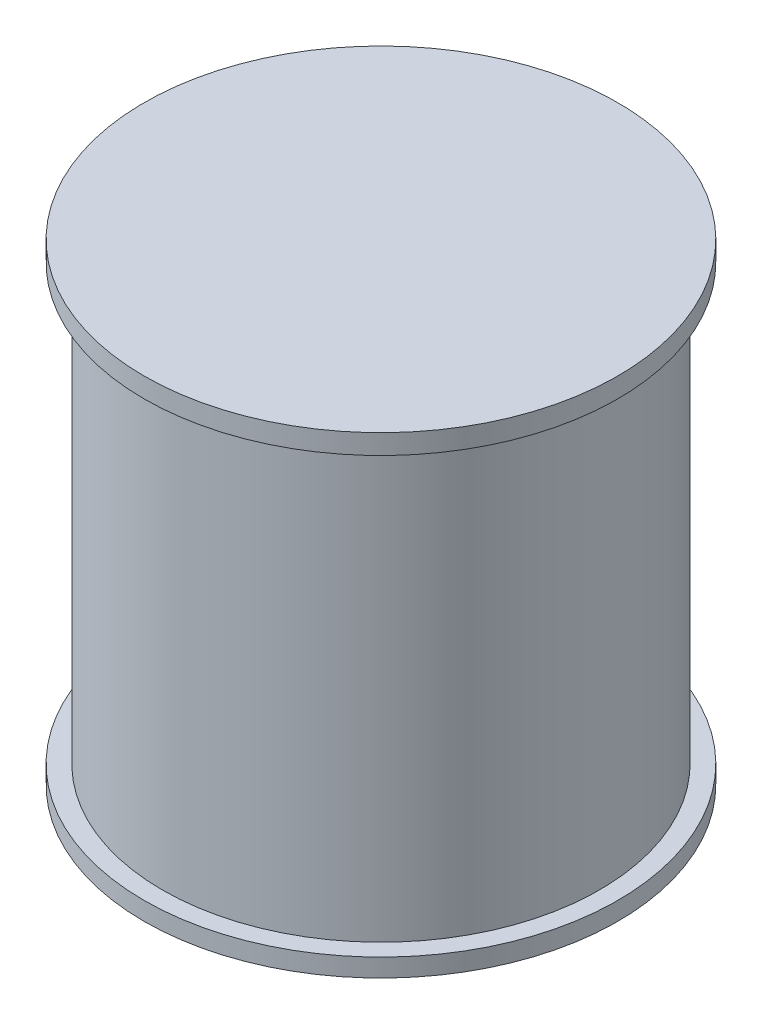
ISO-10303-21;
HEADER;
FILE_DESCRIPTION(('STEP AP214'),'2;1');
FILE_NAME('part.step','',(''),(''),'','','');
FILE_SCHEMA(('AUTOMOTIVE_DESIGN { 1 0 10303 214 1 1 1 1 }'));
ENDSEC;
DATA;
#1=APPLICATION_CONTEXT('core data for automotive mechanical design processes');
#2=APPLICATION_PROTOCOL_DEFINITION('international standard','automotive_design',2000,#1);
#3=PRODUCT_CONTEXT('',#1,'mechanical');
#4=PRODUCT('Part','Part','',(#3));
#5=PRODUCT_RELATED_PRODUCT_CATEGORY('part','',(#4));
#6=PRODUCT_DEFINITION_FORMATION('','',#4);
#7=PRODUCT_DEFINITION_CONTEXT('part definition',#1,'design');
#8=PRODUCT_DEFINITION('design','',#6,#7);
#9=PRODUCT_DEFINITION_SHAPE('','',#8);
#10=(LENGTH_UNIT() NAMED_UNIT(*) SI_UNIT(.MILLI.,.METRE.));
#11=(NAMED_UNIT(*) PLANE_ANGLE_UNIT() SI_UNIT($,.RADIAN.));
#12=(NAMED_UNIT(*) SI_UNIT($,.STERADIAN.) SOLID_ANGLE_UNIT());
#13=UNCERTAINTY_MEASURE_WITH_UNIT(LENGTH_MEASURE(1.E-05),#10,'distance_accuracy_value','');
#14=(GEOMETRIC_REPRESENTATION_CONTEXT(3) GLOBAL_UNCERTAINTY_ASSIGNED_CONTEXT((#13)) GLOBAL_UNIT_ASSIGNED_CONTEXT((#10,
#11,#12)) REPRESENTATION_CONTEXT('',''));
#15=CARTESIAN_POINT('',(0.,0.,0.));
#16=DIRECTION('',(0.,0.,1.));
#17=DIRECTION('',(1.,0.,0.));
#18=AXIS2_PLACEMENT_3D('',#15,#16,#17);
#19=CARTESIAN_POINT('',(50.8214618660544,38.8006335245978,0.));
#20=DIRECTION('',(0.,-1.,0.));
#21=DIRECTION('',(0.,0.,-1.));
#22=AXIS2_PLACEMENT_3D('',#19,#20,#21);
#23=PLANE('',#22);
#24=CARTESIAN_POINT('',(0.,38.8006335245978,0.));
#25=DIRECTION('',(0.,1.,0.));
#26=DIRECTION('',(0.,0.,1.));
#27=AXIS2_PLACEMENT_3D('',#24,#25,#26);
#28=CIRCLE('',#27,50.8214618660544);
#29=CARTESIAN_POINT('',(0.,38.8006335245978,50.8214618660544));
#30=VERTEX_POINT('',#29);
#31=EDGE_CURVE('E113',#30,#30,#28,.T.);
#32=ORIENTED_EDGE('',*,*,#31,.T.);
#33=EDGE_LOOP('',(#32));
#34=FACE_BOUND('',#33,.T.);
#35=ADVANCED_FACE('F33',(#34),#23,.F.);
#36=CARTESIAN_POINT('',(0.,-62.5731282252533,0.));
#37=DIRECTION('',(0.,1.,0.));
#38=DIRECTION('',(0.,0.,1.));
#39=AXIS2_PLACEMENT_3D('',#36,#37,#38);
#40=PLANE('',#39);
#41=CARTESIAN_POINT('',(0.,-62.5731282252533,0.));
#42=DIRECTION('',(0.,1.,0.));
#43=DIRECTION('',(0.,0.,1.));
#44=AXIS2_PLACEMENT_3D('',#41,#42,#43);
#45=CIRCLE('',#44,50.8214618660544);
#46=CARTESIAN_POINT('',(0.,-62.5731282252533,50.8214618660544));
#47=VERTEX_POINT('',#46);
#48=EDGE_CURVE('E147',#47,#47,#45,.T.);
#49=ORIENTED_EDGE('',*,*,#48,.F.);
#50=EDGE_LOOP('',(#49));
#51=FACE_BOUND('',#50,.T.);
#52=ADVANCED_FACE('F177',(#51),#40,.F.);
#53=CARTESIAN_POINT('',(0.,38.8006335245978,0.));
#54=DIRECTION('',(0.,1.,0.));
#55=DIRECTION('',(0.,0.,1.));
#56=AXIS2_PLACEMENT_3D('',#53,#54,#55);
#57=CYLINDRICAL_SURFACE('',#56,50.8214618660544);
#58=CARTESIAN_POINT('',(0.,-58.6741373887206,0.));
#59=DIRECTION('',(0.,1.,0.));
#60=DIRECTION('',(0.,0.,1.));
#61=AXIS2_PLACEMENT_3D('',#58,#59,#60);
#62=CIRCLE('',#61,50.8214618660544);
#63=CARTESIAN_POINT('',(0.,-58.6741373887206,50.8214618660544));
#64=VERTEX_POINT('',#63);
#65=EDGE_CURVE('E144',#64,#64,#62,.T.);
#66=ORIENTED_EDGE('',*,*,#65,.F.);
#67=EDGE_LOOP('',(#66));
#68=FACE_BOUND('',#67,.T.);
#69=ORIENTED_EDGE('',*,*,#48,.T.);
#70=EDGE_LOOP('',(#69));
#71=FACE_BOUND('',#70,.T.);
#72=ADVANCED_FACE('F182',(#68,#71),#57,.T.);
#73=CARTESIAN_POINT('',(50.8214618660544,-58.6741373887206,0.));
#74=DIRECTION('',(0.,-1.,0.));
#75=DIRECTION('',(0.,0.,-1.));
#76=AXIS2_PLACEMENT_3D('',#73,#74,#75);
#77=PLANE('',#76);
#78=CARTESIAN_POINT('',(0.,-58.6741373887206,0.));
#79=DIRECTION('',(0.,1.,0.));
#80=DIRECTION('',(0.,0.,1.));
#81=AXIS2_PLACEMENT_3D('',#78,#79,#80);
#82=CIRCLE('',#81,46.9224710295217);
#83=CARTESIAN_POINT('',(0.,-58.6741373887206,46.9224710295217));
#84=VERTEX_POINT('',#83);
#85=EDGE_CURVE('E141',#84,#84,#82,.T.);
#86=ORIENTED_EDGE('',*,*,#85,.F.);
#87=EDGE_LOOP('',(#86));
#88=FACE_BOUND('',#87,.T.);
#89=ORIENTED_EDGE('',*,*,#65,.T.);
#90=EDGE_LOOP('',(#89));
#91=FACE_BOUND('',#90,.T.);
#92=ADVANCED_FACE('F201',(#88,#91),#77,.F.);
#93=CARTESIAN_POINT('',(0.,38.8006335245978,0.));
#94=DIRECTION('',(0.,1.,0.));
#95=DIRECTION('',(0.,0.,1.));
#96=AXIS2_PLACEMENT_3D('',#93,#94,#95);
#97=CYLINDRICAL_SURFACE('',#96,46.9224710295217);
#98=CARTESIAN_POINT('',(0.,34.547188975653,0.));
#99=DIRECTION('',(0.,0.999847695156391,-0.0174524064372835));
#100=DIRECTION('',(0.,0.0174524064372835,0.999847695156391));
#101=AXIS2_PLACEMENT_3D('',#98,#99,#100);
#102=ELLIPSE('',#101,46.9296186377489,46.9224710295217);
#103=CARTESIAN_POINT('',(-39.7079121525711,34.1108123524476,-25.));
#104=VERTEX_POINT('',#103);
#105=CARTESIAN_POINT('',(-40.975413337519,34.1481073290499,-22.8633722214324));
#106=VERTEX_POINT('',#105);
#107=EDGE_CURVE('E40',#104,#106,#102,.T.);
#108=ORIENTED_EDGE('',*,*,#107,.T.);
#109=DIRECTION('',(0.,1.,0.));
#110=VECTOR('',#109,1.);
#111=CARTESIAN_POINT('',(-40.975413337519,38.8006335245978,-22.8633722214325));
#112=LINE('',#111,#110);
#113=CARTESIAN_POINT('',(-40.975413337519,-58.2750557421175,-22.8633722214324));
#114=VERTEX_POINT('',#113);
#115=EDGE_CURVE('E11',#106,#114,#112,.F.);
#116=ORIENTED_EDGE('',*,*,#115,.T.);
#117=CARTESIAN_POINT('',(0.,-58.6741373887206,0.));
#118=DIRECTION('',(0.,-0.999847695156391,-0.0174524064372835));
#119=DIRECTION('',(0.,0.0174524064372835,-0.999847695156391));
#120=AXIS2_PLACEMENT_3D('',#117,#118,#119);
#121=ELLIPSE('',#120,46.9296186377489,46.9224710295217);
#122=CARTESIAN_POINT('',(-39.7079121525711,-58.2377607655151,-25.));
#123=VERTEX_POINT('',#122);
#124=EDGE_CURVE('E164',#114,#123,#121,.T.);
#125=ORIENTED_EDGE('',*,*,#124,.T.);
#126=DIRECTION('',(0.,1.,0.));
#127=VECTOR('',#126,1.);
#128=CARTESIAN_POINT('',(-39.7079121525711,38.8006335245978,-25.));
#129=LINE('',#128,#127);
#130=EDGE_CURVE('E162',#104,#123,#129,.F.);
#131=ORIENTED_EDGE('',*,*,#130,.F.);
#132=EDGE_LOOP('',(#108,#116,#125,#131));
#133=FACE_BOUND('',#132,.T.);
#134=CARTESIAN_POINT('',(0.,34.5263314076446,0.));
#135=DIRECTION('',(0.,0.999847695156391,-0.0174524064372835));
#136=DIRECTION('',(0.,0.0174524064372835,0.999847695156391));
#137=AXIS2_PLACEMENT_3D('',#134,#135,#136);
#138=ELLIPSE('',#137,46.9296186377489,46.9224710295217);
#139=CARTESIAN_POINT('',(-44.6487330998803,34.2744644858615,-14.4294462850089));
#140=VERTEX_POINT('',#139);
#141=CARTESIAN_POINT('',(-46.851992422461,34.4814576520084,-2.5708157386236));
#142=VERTEX_POINT('',#141);
#143=EDGE_CURVE('E156',#140,#142,#138,.T.);
#144=ORIENTED_EDGE('',*,*,#143,.T.);
#145=DIRECTION('',(0.,1.,0.));
#146=VECTOR('',#145,1.);
#147=CARTESIAN_POINT('',(-46.851992422461,38.8006335245978,-2.57081573862373));
#148=LINE('',#147,#146);
#149=CARTESIAN_POINT('',(-46.851992422461,-58.6292636330844,-2.5708157386236));
#150=VERTEX_POINT('',#149);
#151=EDGE_CURVE('E159',#142,#150,#148,.F.);
#152=ORIENTED_EDGE('',*,*,#151,.T.);
#153=CARTESIAN_POINT('',(0.,-58.6741373887206,0.));
#154=DIRECTION('',(0.,-0.999847695156391,-0.0174524064372835));
#155=DIRECTION('',(0.,0.0174524064372835,-0.999847695156391));
#156=AXIS2_PLACEMENT_3D('',#153,#154,#155);
#157=ELLIPSE('',#156,46.9296186377489,46.9224710295217);
#158=CARTESIAN_POINT('',(-44.6487330998803,-58.4222704669375,-14.429446285009));
#159=VERTEX_POINT('',#158);
#160=EDGE_CURVE('E150',#150,#159,#157,.T.);
#161=ORIENTED_EDGE('',*,*,#160,.T.);
#162=DIRECTION('',(0.,1.,0.));
#163=VECTOR('',#162,1.);
#164=CARTESIAN_POINT('',(-44.6487330998803,38.8006335245978,-14.4294462850089));
#165=LINE('',#164,#163);
#166=EDGE_CURVE('E153',#159,#140,#165,.T.);
#167=ORIENTED_EDGE('',*,*,#166,.T.);
#168=EDGE_LOOP('',(#144,#152,#161,#167));
#169=FACE_BOUND('',#168,.T.);
#170=CARTESIAN_POINT('',(0.,34.547188975653,0.));
#171=DIRECTION('',(0.,1.,0.));
#172=DIRECTION('',(0.,0.,1.));
#173=AXIS2_PLACEMENT_3D('',#170,#171,#172);
#174=CIRCLE('',#173,46.9224710295217);
#175=CARTESIAN_POINT('',(0.,34.547188975653,46.9224710295217));
#176=VERTEX_POINT('',#175);
#177=EDGE_CURVE('E138',#176,#176,#174,.T.);
#178=ORIENTED_EDGE('',*,*,#177,.F.);
#179=EDGE_LOOP('',(#178));
#180=FACE_BOUND('',#179,.T.);
#181=ORIENTED_EDGE('',*,*,#85,.T.);
#182=EDGE_LOOP('',(#181));
#183=FACE_BOUND('',#182,.T.);
#184=ADVANCED_FACE('F165',(#133,#169,#180,#183),#97,.T.);
#185=CARTESIAN_POINT('',(46.9224710295217,34.547188975653,0.));
#186=DIRECTION('',(0.,1.,0.));
#187=DIRECTION('',(0.,0.,1.));
#188=AXIS2_PLACEMENT_3D('',#185,#186,#187);
#189=PLANE('',#188);
#190=CARTESIAN_POINT('',(0.,34.547188975653,0.));
#191=DIRECTION('',(0.,1.,0.));
#192=DIRECTION('',(0.,0.,1.));
#193=AXIS2_PLACEMENT_3D('',#190,#191,#192);
#194=CIRCLE('',#193,50.8214618660544);
#195=CARTESIAN_POINT('',(0.,34.547188975653,50.8214618660544));
#196=VERTEX_POINT('',#195);
#197=EDGE_CURVE('E135',#196,#196,#194,.T.);
#198=ORIENTED_EDGE('',*,*,#197,.F.);
#199=EDGE_LOOP('',(#198));
#200=FACE_BOUND('',#199,.T.);
#201=ORIENTED_EDGE('',*,*,#177,.T.);
#202=EDGE_LOOP('',(#201));
#203=FACE_BOUND('',#202,.T.);
#204=ADVANCED_FACE('F190',(#200,#203),#189,.F.);
#205=CARTESIAN_POINT('',(0.,38.8006335245978,0.));
#206=DIRECTION('',(0.,1.,0.));
#207=DIRECTION('',(0.,0.,1.));
#208=AXIS2_PLACEMENT_3D('',#205,#206,#207);
#209=CYLINDRICAL_SURFACE('',#208,50.8214618660544);
#210=ORIENTED_EDGE('',*,*,#31,.F.);
#211=EDGE_LOOP('',(#210));
#212=FACE_BOUND('',#211,.T.);
#213=ORIENTED_EDGE('',*,*,#197,.T.);
#214=EDGE_LOOP('',(#213));
#215=FACE_BOUND('',#214,.T.);
#216=ADVANCED_FACE('F186',(#212,#215),#209,.T.);
#217=CARTESIAN_POINT('',(-46.8968661780972,34.5263314076446,0.));
#218=DIRECTION('',(-0.999847695156391,0.,-0.0174524064372835));
#219=DIRECTION('',(-0.0174524064372835,0.,0.999847695156391));
#220=AXIS2_PLACEMENT_3D('',#217,#218,#219);
#221=PLANE('',#220);
#222=ORIENTED_EDGE('',*,*,#151,.F.);
#223=DIRECTION('',(-0.0174497491606827,0.0174497491606827,0.999695459881887));
#224=VECTOR('',#223,1.);
#225=CARTESIAN_POINT('',(-46.8968661780972,34.5263314076446,0.));
#226=LINE('',#225,#224);
#227=CARTESIAN_POINT('',(-46.4604895548918,34.0899547844391,-25.));
#228=VERTEX_POINT('',#227);
#229=EDGE_CURVE('E110',#228,#142,#226,.T.);
#230=ORIENTED_EDGE('',*,*,#229,.F.);
#231=DIRECTION('',(0.,-1.,0.));
#232=VECTOR('',#231,1.);
#233=CARTESIAN_POINT('',(-46.4604895548918,0.,-25.));
#234=LINE('',#233,#232);
#235=CARTESIAN_POINT('',(-46.4604895548918,-58.2377607655151,-25.));
#236=VERTEX_POINT('',#235);
#237=EDGE_CURVE('E101',#228,#236,#234,.T.);
#238=ORIENTED_EDGE('',*,*,#237,.T.);
#239=DIRECTION('',(-0.0174497491606827,-0.0174497491606827,0.999695459881887));
#240=VECTOR('',#239,1.);
#241=CARTESIAN_POINT('',(-46.8684872182458,-58.6457584288692,-1.62582952100727));
#242=LINE('',#241,#240);
#243=EDGE_CURVE('E115',#236,#150,#242,.T.);
#244=ORIENTED_EDGE('',*,*,#243,.T.);
#245=EDGE_LOOP('',(#222,#230,#238,#244));
#246=FACE_BOUND('',#245,.T.);
#247=ADVANCED_FACE('F189',(#246),#221,.T.);
#248=CARTESIAN_POINT('',(-44.3968661780972,34.5263314076446,0.));
#249=DIRECTION('',(0.999847695156391,0.,-0.0174524064372835));
#250=DIRECTION('',(-0.0174524064372835,0.,-0.999847695156391));
#251=AXIS2_PLACEMENT_3D('',#248,#249,#250);
#252=PLANE('',#251);
#253=ORIENTED_EDGE('',*,*,#166,.F.);
#254=DIRECTION('',(0.0174497491606827,-0.0174497491606827,0.999695459881887));
#255=VECTOR('',#254,1.);
#256=CARTESIAN_POINT('',(-44.3976274124616,-58.6733761543562,-0.0436110875300308));
#257=LINE('',#256,#255);
#258=CARTESIAN_POINT('',(-44.8332428013026,-58.2377607655151,-25.));
#259=VERTEX_POINT('',#258);
#260=EDGE_CURVE('E118',#259,#159,#257,.T.);
#261=ORIENTED_EDGE('',*,*,#260,.F.);
#262=DIRECTION('',(0.,1.,0.));
#263=VECTOR('',#262,1.);
#264=CARTESIAN_POINT('',(-44.8332428013026,0.,-25.));
#265=LINE('',#264,#263);
#266=CARTESIAN_POINT('',(-44.8332428013027,34.0899547844391,-25.));
#267=VERTEX_POINT('',#266);
#268=EDGE_CURVE('E128',#259,#267,#265,.T.);
#269=ORIENTED_EDGE('',*,*,#268,.T.);
#270=DIRECTION('',(0.0174497491606827,0.0174497491606827,0.999695459881887));
#271=VECTOR('',#270,1.);
#272=CARTESIAN_POINT('',(-44.3968661780972,34.5263314076446,0.));
#273=LINE('',#272,#271);
#274=EDGE_CURVE('E114',#267,#140,#273,.T.);
#275=ORIENTED_EDGE('',*,*,#274,.T.);
#276=EDGE_LOOP('',(#253,#261,#269,#275));
#277=FACE_BOUND('',#276,.T.);
#278=ADVANCED_FACE('F221',(#277),#252,.T.);
#279=CARTESIAN_POINT('',(-46.8968661780972,34.5263314076446,0.));
#280=DIRECTION('',(0.,0.999847695156391,-0.0174524064372835));
#281=DIRECTION('',(0.,0.0174524064372835,0.999847695156391));
#282=AXIS2_PLACEMENT_3D('',#279,#280,#281);
#283=PLANE('',#282);
#284=ORIENTED_EDGE('',*,*,#143,.F.);
#285=ORIENTED_EDGE('',*,*,#274,.F.);
#286=DIRECTION('',(-1.,0.,0.));
#287=VECTOR('',#286,1.);
#288=CARTESIAN_POINT('',(0.,34.0899547844391,-25.));
#289=LINE('',#288,#287);
#290=EDGE_CURVE('E119',#267,#228,#289,.T.);
#291=ORIENTED_EDGE('',*,*,#290,.T.);
#292=ORIENTED_EDGE('',*,*,#229,.T.);
#293=EDGE_LOOP('',(#284,#285,#291,#292));
#294=FACE_BOUND('',#293,.T.);
#295=ADVANCED_FACE('F217',(#294),#283,.T.);
#296=CARTESIAN_POINT('',(-46.8968661780972,-58.6741373887206,0.));
#297=DIRECTION('',(0.,-0.999847695156391,-0.0174524064372835));
#298=DIRECTION('',(0.,0.0174524064372835,-0.999847695156391));
#299=AXIS2_PLACEMENT_3D('',#296,#297,#298);
#300=PLANE('',#299);
#301=ORIENTED_EDGE('',*,*,#160,.F.);
#302=ORIENTED_EDGE('',*,*,#243,.F.);
#303=DIRECTION('',(1.,0.,0.));
#304=VECTOR('',#303,1.);
#305=CARTESIAN_POINT('',(0.,-58.2377607655151,-25.));
#306=LINE('',#305,#304);
#307=EDGE_CURVE('E125',#236,#259,#306,.T.);
#308=ORIENTED_EDGE('',*,*,#307,.T.);
#309=ORIENTED_EDGE('',*,*,#260,.T.);
#310=EDGE_LOOP('',(#301,#302,#308,#309));
#311=FACE_BOUND('',#310,.T.);
#312=ADVANCED_FACE('F220',(#311),#300,.T.);
#313=CARTESIAN_POINT('',(0.,0.,-25.));
#314=DIRECTION('',(0.,0.,1.));
#315=DIRECTION('',(1.,0.,0.));
#316=AXIS2_PLACEMENT_3D('',#313,#314,#315);
#317=PLANE('',#316);
#318=ORIENTED_EDGE('',*,*,#237,.F.);
#319=ORIENTED_EDGE('',*,*,#290,.F.);
#320=ORIENTED_EDGE('',*,*,#268,.F.);
#321=ORIENTED_EDGE('',*,*,#307,.F.);
#322=EDGE_LOOP('',(#318,#319,#320,#321));
#323=FACE_BOUND('',#322,.T.);
#324=ADVANCED_FACE('F228',(#323),#317,.F.);
#325=CARTESIAN_POINT('',(-41.3744949841221,34.547188975653,0.));
#326=DIRECTION('',(-0.999847695156391,0.,-0.0174524064372835));
#327=DIRECTION('',(-0.0174524064372835,0.,0.999847695156391));
#328=AXIS2_PLACEMENT_3D('',#325,#326,#327);
#329=PLANE('',#328);
#330=ORIENTED_EDGE('',*,*,#115,.F.);
#331=DIRECTION('',(-0.0174497491606827,0.0174497491606827,0.999695459881887));
#332=VECTOR('',#331,1.);
#333=CARTESIAN_POINT('',(-41.3744949841221,34.547188975653,0.));
#334=LINE('',#333,#332);
#335=CARTESIAN_POINT('',(-40.9381183609167,34.1108123524476,-25.));
#336=VERTEX_POINT('',#335);
#337=EDGE_CURVE('E89',#336,#106,#334,.T.);
#338=ORIENTED_EDGE('',*,*,#337,.F.);
#339=DIRECTION('',(0.,-1.,0.));
#340=VECTOR('',#339,1.);
#341=CARTESIAN_POINT('',(-40.9381183609167,0.,-25.));
#342=LINE('',#341,#340);
#343=CARTESIAN_POINT('',(-40.9381183609167,-58.2377607655151,-25.));
#344=VERTEX_POINT('',#343);
#345=EDGE_CURVE('E100',#336,#344,#342,.T.);
#346=ORIENTED_EDGE('',*,*,#345,.T.);
#347=DIRECTION('',(-0.0174497491606827,-0.0174497491606827,0.999695459881887));
#348=VECTOR('',#347,1.);
#349=CARTESIAN_POINT('',(-41.3461096732717,-58.6457520778702,-1.6261933694969));
#350=LINE('',#349,#348);
#351=EDGE_CURVE('E93',#344,#114,#350,.T.);
#352=ORIENTED_EDGE('',*,*,#351,.T.);
#353=EDGE_LOOP('',(#330,#338,#346,#352));
#354=FACE_BOUND('',#353,.T.);
#355=ADVANCED_FACE('F98',(#354),#329,.T.);
#356=CARTESIAN_POINT('',(0.,0.,-25.));
#357=DIRECTION('',(0.,0.,1.));
#358=DIRECTION('',(1.,0.,0.));
#359=AXIS2_PLACEMENT_3D('',#356,#357,#358);
#360=PLANE('',#359);
#361=DIRECTION('',(-1.,0.,0.));
#362=VECTOR('',#361,1.);
#363=CARTESIAN_POINT('',(0.,34.1108123524476,-25.));
#364=LINE('',#363,#362);
#365=EDGE_CURVE('E86',#104,#336,#364,.T.);
#366=ORIENTED_EDGE('',*,*,#365,.F.);
#367=ORIENTED_EDGE('',*,*,#130,.T.);
#368=DIRECTION('',(1.,0.,0.));
#369=VECTOR('',#368,1.);
#370=CARTESIAN_POINT('',(0.,-58.2377607655151,-25.));
#371=LINE('',#370,#369);
#372=EDGE_CURVE('E94',#344,#123,#371,.T.);
#373=ORIENTED_EDGE('',*,*,#372,.F.);
#374=ORIENTED_EDGE('',*,*,#345,.F.);
#375=EDGE_LOOP('',(#366,#367,#373,#374));
#376=FACE_BOUND('',#375,.T.);
#377=ADVANCED_FACE('F104',(#376),#360,.F.);
#378=CARTESIAN_POINT('',(-41.3744949841221,34.547188975653,0.));
#379=DIRECTION('',(0.,0.999847695156391,-0.0174524064372835));
#380=DIRECTION('',(0.,0.0174524064372835,0.999847695156391));
#381=AXIS2_PLACEMENT_3D('',#378,#379,#380);
#382=PLANE('',#381);
#383=ORIENTED_EDGE('',*,*,#107,.F.);
#384=ORIENTED_EDGE('',*,*,#365,.T.);
#385=ORIENTED_EDGE('',*,*,#337,.T.);
#386=EDGE_LOOP('',(#383,#384,#385));
#387=FACE_BOUND('',#386,.T.);
#388=ADVANCED_FACE('F88',(#387),#382,.T.);
#389=CARTESIAN_POINT('',(-41.3744949841221,-58.6741373887206,0.));
#390=DIRECTION('',(0.,-0.999847695156391,-0.0174524064372835));
#391=DIRECTION('',(0.,0.0174524064372835,-0.999847695156391));
#392=AXIS2_PLACEMENT_3D('',#389,#390,#391);
#393=PLANE('',#392);
#394=ORIENTED_EDGE('',*,*,#124,.F.);
#395=ORIENTED_EDGE('',*,*,#351,.F.);
#396=ORIENTED_EDGE('',*,*,#372,.T.);
#397=EDGE_LOOP('',(#394,#395,#396));
#398=FACE_BOUND('',#397,.T.);
#399=ADVANCED_FACE('F168',(#398),#393,.T.);
#400=CLOSED_SHELL('',(#35,#52,#72,#92,#184,#204,#216,#247,#278,#295,#312,#324,#355,#377,#388,#399));
#401=MANIFOLD_SOLID_BREP('B2',#400);
#402=ADVANCED_BREP_SHAPE_REPRESENTATION('',(#18,#401),#14);
#403=SHAPE_DEFINITION_REPRESENTATION(#9,#402);
ENDSEC;
END-ISO-10303-21;
